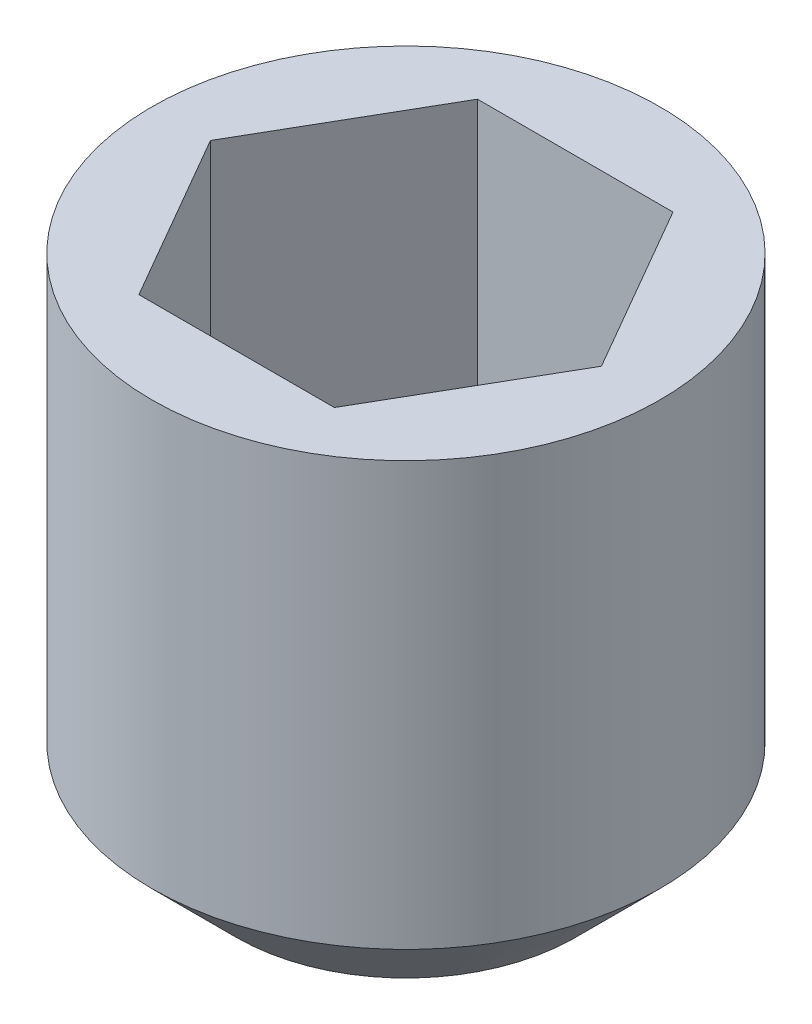
ISO-10303-21;
HEADER;
FILE_DESCRIPTION(('STEP AP214'),'2;1');
FILE_NAME('part.step','',(''),(''),'','','');
FILE_SCHEMA(('AUTOMOTIVE_DESIGN { 1 0 10303 214 1 1 1 1 }'));
ENDSEC;
DATA;
#1=APPLICATION_CONTEXT('core data for automotive mechanical design processes');
#2=APPLICATION_PROTOCOL_DEFINITION('international standard','automotive_design',2000,#1);
#3=PRODUCT_CONTEXT('',#1,'mechanical');
#4=PRODUCT('Part','Part','',(#3));
#5=PRODUCT_RELATED_PRODUCT_CATEGORY('part','',(#4));
#6=PRODUCT_DEFINITION_FORMATION('','',#4);
#7=PRODUCT_DEFINITION_CONTEXT('part definition',#1,'design');
#8=PRODUCT_DEFINITION('design','',#6,#7);
#9=PRODUCT_DEFINITION_SHAPE('','',#8);
#10=(LENGTH_UNIT() NAMED_UNIT(*) SI_UNIT(.MILLI.,.METRE.));
#11=(NAMED_UNIT(*) PLANE_ANGLE_UNIT() SI_UNIT($,.RADIAN.));
#12=(NAMED_UNIT(*) SI_UNIT($,.STERADIAN.) SOLID_ANGLE_UNIT());
#13=UNCERTAINTY_MEASURE_WITH_UNIT(LENGTH_MEASURE(1.E-05),#10,'distance_accuracy_value','');
#14=(GEOMETRIC_REPRESENTATION_CONTEXT(3) GLOBAL_UNCERTAINTY_ASSIGNED_CONTEXT((#13)) GLOBAL_UNIT_ASSIGNED_CONTEXT((#10,
#11,#12)) REPRESENTATION_CONTEXT('',''));
#15=CARTESIAN_POINT('',(0.,0.,0.));
#16=DIRECTION('',(0.,0.,1.));
#17=DIRECTION('',(1.,0.,0.));
#18=AXIS2_PLACEMENT_3D('',#15,#16,#17);
#19=CARTESIAN_POINT('',(0.,3.,0.));
#20=DIRECTION('',(0.,-1.,0.));
#21=DIRECTION('',(0.,0.,-1.));
#22=AXIS2_PLACEMENT_3D('',#19,#20,#21);
#23=CYLINDRICAL_SURFACE('',#22,1.5);
#24=CARTESIAN_POINT('',(0.,0.5,0.));
#25=DIRECTION('',(0.,1.,0.));
#26=DIRECTION('',(0.,0.,1.));
#27=AXIS2_PLACEMENT_3D('',#24,#25,#26);
#28=CIRCLE('',#27,1.5);
#29=CARTESIAN_POINT('',(0.,0.5,1.5));
#30=VERTEX_POINT('',#29);
#31=EDGE_CURVE('E42',#30,#30,#28,.T.);
#32=ORIENTED_EDGE('',*,*,#31,.T.);
#33=EDGE_LOOP('',(#32));
#34=FACE_BOUND('',#33,.T.);
#35=CARTESIAN_POINT('',(0.,3.,0.));
#36=DIRECTION('',(0.,1.,0.));
#37=DIRECTION('',(0.,0.,1.));
#38=AXIS2_PLACEMENT_3D('',#35,#36,#37);
#39=CIRCLE('',#38,1.5);
#40=CARTESIAN_POINT('',(0.,3.,1.5));
#41=VERTEX_POINT('',#40);
#42=EDGE_CURVE('E136',#41,#41,#39,.T.);
#43=ORIENTED_EDGE('',*,*,#42,.F.);
#44=EDGE_LOOP('',(#43));
#45=FACE_BOUND('',#44,.T.);
#46=ADVANCED_FACE('F34',(#34,#45),#23,.T.);
#47=CARTESIAN_POINT('',(0.,3.,0.));
#48=DIRECTION('',(0.,1.,0.));
#49=DIRECTION('',(0.,0.,1.));
#50=AXIS2_PLACEMENT_3D('',#47,#48,#49);
#51=PLANE('',#50);
#52=DIRECTION('',(1.,0.,0.));
#53=VECTOR('',#52,1.);
#54=CARTESIAN_POINT('',(-0.577350269189626,3.,1.));
#55=LINE('',#54,#53);
#56=CARTESIAN_POINT('',(-0.577350269189626,3.,1.));
#57=VERTEX_POINT('',#56);
#58=CARTESIAN_POINT('',(0.577350269189626,3.,1.));
#59=VERTEX_POINT('',#58);
#60=EDGE_CURVE('E49',#57,#59,#55,.T.);
#61=ORIENTED_EDGE('',*,*,#60,.F.);
#62=DIRECTION('',(0.5,0.,0.866025403784439));
#63=VECTOR('',#62,1.);
#64=CARTESIAN_POINT('',(-1.15470053837925,3.,0.));
#65=LINE('',#64,#63);
#66=CARTESIAN_POINT('',(-1.15470053837925,3.,0.));
#67=VERTEX_POINT('',#66);
#68=EDGE_CURVE('E132',#67,#57,#65,.T.);
#69=ORIENTED_EDGE('',*,*,#68,.F.);
#70=DIRECTION('',(-0.5,0.,0.866025403784438));
#71=VECTOR('',#70,1.);
#72=CARTESIAN_POINT('',(-0.577350269189626,3.,-1.));
#73=LINE('',#72,#71);
#74=CARTESIAN_POINT('',(-0.577350269189626,3.,-1.));
#75=VERTEX_POINT('',#74);
#76=EDGE_CURVE('E130',#75,#67,#73,.T.);
#77=ORIENTED_EDGE('',*,*,#76,.F.);
#78=DIRECTION('',(-1.,0.,0.));
#79=VECTOR('',#78,1.);
#80=CARTESIAN_POINT('',(0.577350269189625,3.,-1.));
#81=LINE('',#80,#79);
#82=CARTESIAN_POINT('',(0.577350269189625,3.,-1.));
#83=VERTEX_POINT('',#82);
#84=EDGE_CURVE('E97',#83,#75,#81,.T.);
#85=ORIENTED_EDGE('',*,*,#84,.F.);
#86=DIRECTION('',(-0.5,0.,-0.866025403784438));
#87=VECTOR('',#86,1.);
#88=CARTESIAN_POINT('',(1.15470053837925,3.,0.));
#89=LINE('',#88,#87);
#90=CARTESIAN_POINT('',(1.15470053837925,3.,0.));
#91=VERTEX_POINT('',#90);
#92=EDGE_CURVE('E126',#91,#83,#89,.T.);
#93=ORIENTED_EDGE('',*,*,#92,.F.);
#94=DIRECTION('',(0.5,0.,-0.866025403784439));
#95=VECTOR('',#94,1.);
#96=CARTESIAN_POINT('',(0.577350269189626,3.,1.));
#97=LINE('',#96,#95);
#98=EDGE_CURVE('E123',#59,#91,#97,.T.);
#99=ORIENTED_EDGE('',*,*,#98,.F.);
#100=EDGE_LOOP('',(#61,#69,#77,#85,#93,#99));
#101=FACE_BOUND('',#100,.T.);
#102=ORIENTED_EDGE('',*,*,#42,.T.);
#103=EDGE_LOOP('',(#102));
#104=FACE_BOUND('',#103,.T.);
#105=ADVANCED_FACE('F158',(#101,#104),#51,.T.);
#106=CARTESIAN_POINT('',(0.,0.,0.));
#107=DIRECTION('',(0.,1.,0.));
#108=DIRECTION('',(0.,0.,1.));
#109=AXIS2_PLACEMENT_3D('',#106,#107,#108);
#110=PLANE('',#109);
#111=CARTESIAN_POINT('',(0.,0.,0.));
#112=DIRECTION('',(0.,1.,0.));
#113=DIRECTION('',(0.,0.,1.));
#114=AXIS2_PLACEMENT_3D('',#111,#112,#113);
#115=CIRCLE('',#114,0.999999999999999);
#116=CARTESIAN_POINT('',(0.,0.,0.999999999999999));
#117=VERTEX_POINT('',#116);
#118=EDGE_CURVE('E11',#117,#117,#115,.F.);
#119=ORIENTED_EDGE('',*,*,#118,.T.);
#120=EDGE_LOOP('',(#119));
#121=FACE_BOUND('',#120,.T.);
#122=ADVANCED_FACE('F150',(#121),#110,.F.);
#123=CARTESIAN_POINT('',(0.,0.5,0.));
#124=DIRECTION('',(0.,1.,0.));
#125=DIRECTION('',(0.,0.,1.));
#126=AXIS2_PLACEMENT_3D('',#123,#124,#125);
#127=CONICAL_SURFACE('',#126,1.5,0.78539816339745);
#128=ORIENTED_EDGE('',*,*,#118,.F.);
#129=EDGE_LOOP('',(#128));
#130=FACE_BOUND('',#129,.T.);
#131=ORIENTED_EDGE('',*,*,#31,.F.);
#132=EDGE_LOOP('',(#131));
#133=FACE_BOUND('',#132,.T.);
#134=ADVANCED_FACE('F36',(#130,#133),#127,.T.);
#135=CARTESIAN_POINT('',(-0.577350269189626,1.5,1.));
#136=DIRECTION('',(0.,0.,1.));
#137=DIRECTION('',(1.,0.,0.));
#138=AXIS2_PLACEMENT_3D('',#135,#136,#137);
#139=PLANE('',#138);
#140=ORIENTED_EDGE('',*,*,#60,.T.);
#141=DIRECTION('',(0.,1.,0.));
#142=VECTOR('',#141,1.);
#143=CARTESIAN_POINT('',(0.577350269189626,1.5,1.));
#144=LINE('',#143,#142);
#145=CARTESIAN_POINT('',(0.577350269189626,1.5,1.));
#146=VERTEX_POINT('',#145);
#147=EDGE_CURVE('E79',#146,#59,#144,.T.);
#148=ORIENTED_EDGE('',*,*,#147,.F.);
#149=DIRECTION('',(1.,0.,0.));
#150=VECTOR('',#149,1.);
#151=CARTESIAN_POINT('',(-0.577350269189626,1.5,1.));
#152=LINE('',#151,#150);
#153=CARTESIAN_POINT('',(-0.577350269189626,1.5,1.));
#154=VERTEX_POINT('',#153);
#155=EDGE_CURVE('E134',#154,#146,#152,.T.);
#156=ORIENTED_EDGE('',*,*,#155,.F.);
#157=DIRECTION('',(0.,1.,0.));
#158=VECTOR('',#157,1.);
#159=CARTESIAN_POINT('',(-0.577350269189626,1.5,1.));
#160=LINE('',#159,#158);
#161=EDGE_CURVE('E57',#154,#57,#160,.T.);
#162=ORIENTED_EDGE('',*,*,#161,.T.);
#163=EDGE_LOOP('',(#140,#148,#156,#162));
#164=FACE_BOUND('',#163,.T.);
#165=ADVANCED_FACE('F149',(#164),#139,.F.);
#166=CARTESIAN_POINT('',(-1.15470053837925,1.5,0.));
#167=DIRECTION('',(-0.866025403784439,0.,0.5));
#168=DIRECTION('',(0.5,0.,0.866025403784439));
#169=AXIS2_PLACEMENT_3D('',#166,#167,#168);
#170=PLANE('',#169);
#171=ORIENTED_EDGE('',*,*,#68,.T.);
#172=ORIENTED_EDGE('',*,*,#161,.F.);
#173=DIRECTION('',(0.5,0.,0.866025403784439));
#174=VECTOR('',#173,1.);
#175=CARTESIAN_POINT('',(-1.15470053837925,1.5,0.));
#176=LINE('',#175,#174);
#177=CARTESIAN_POINT('',(-1.15470053837925,1.5,0.));
#178=VERTEX_POINT('',#177);
#179=EDGE_CURVE('E109',#178,#154,#176,.T.);
#180=ORIENTED_EDGE('',*,*,#179,.F.);
#181=DIRECTION('',(0.,1.,0.));
#182=VECTOR('',#181,1.);
#183=CARTESIAN_POINT('',(-1.15470053837925,1.5,0.));
#184=LINE('',#183,#182);
#185=EDGE_CURVE('E101',#178,#67,#184,.T.);
#186=ORIENTED_EDGE('',*,*,#185,.T.);
#187=EDGE_LOOP('',(#171,#172,#180,#186));
#188=FACE_BOUND('',#187,.T.);
#189=ADVANCED_FACE('F156',(#188),#170,.F.);
#190=CARTESIAN_POINT('',(-0.577350269189626,1.5,-1.));
#191=DIRECTION('',(-0.866025403784439,0.,-0.5));
#192=DIRECTION('',(-0.5,0.,0.866025403784439));
#193=AXIS2_PLACEMENT_3D('',#190,#191,#192);
#194=PLANE('',#193);
#195=ORIENTED_EDGE('',*,*,#76,.T.);
#196=ORIENTED_EDGE('',*,*,#185,.F.);
#197=DIRECTION('',(-0.5,0.,0.866025403784438));
#198=VECTOR('',#197,1.);
#199=CARTESIAN_POINT('',(-0.577350269189626,1.5,-1.));
#200=LINE('',#199,#198);
#201=CARTESIAN_POINT('',(-0.577350269189626,1.5,-1.));
#202=VERTEX_POINT('',#201);
#203=EDGE_CURVE('E105',#202,#178,#200,.T.);
#204=ORIENTED_EDGE('',*,*,#203,.F.);
#205=DIRECTION('',(0.,1.,0.));
#206=VECTOR('',#205,1.);
#207=CARTESIAN_POINT('',(-0.577350269189626,1.5,-1.));
#208=LINE('',#207,#206);
#209=EDGE_CURVE('E90',#202,#75,#208,.T.);
#210=ORIENTED_EDGE('',*,*,#209,.T.);
#211=EDGE_LOOP('',(#195,#196,#204,#210));
#212=FACE_BOUND('',#211,.T.);
#213=ADVANCED_FACE('F106',(#212),#194,.F.);
#214=CARTESIAN_POINT('',(0.577350269189625,1.5,-1.));
#215=DIRECTION('',(0.,0.,-1.));
#216=DIRECTION('',(-1.,0.,0.));
#217=AXIS2_PLACEMENT_3D('',#214,#215,#216);
#218=PLANE('',#217);
#219=ORIENTED_EDGE('',*,*,#84,.T.);
#220=ORIENTED_EDGE('',*,*,#209,.F.);
#221=DIRECTION('',(-1.,0.,0.));
#222=VECTOR('',#221,1.);
#223=CARTESIAN_POINT('',(0.577350269189625,1.5,-1.));
#224=LINE('',#223,#222);
#225=CARTESIAN_POINT('',(0.577350269189625,1.5,-1.));
#226=VERTEX_POINT('',#225);
#227=EDGE_CURVE('E94',#226,#202,#224,.T.);
#228=ORIENTED_EDGE('',*,*,#227,.F.);
#229=DIRECTION('',(0.,1.,0.));
#230=VECTOR('',#229,1.);
#231=CARTESIAN_POINT('',(0.577350269189625,1.5,-1.));
#232=LINE('',#231,#230);
#233=EDGE_CURVE('E102',#226,#83,#232,.T.);
#234=ORIENTED_EDGE('',*,*,#233,.T.);
#235=EDGE_LOOP('',(#219,#220,#228,#234));
#236=FACE_BOUND('',#235,.T.);
#237=ADVANCED_FACE('F92',(#236),#218,.F.);
#238=CARTESIAN_POINT('',(1.15470053837925,1.5,0.));
#239=DIRECTION('',(0.866025403784439,0.,-0.5));
#240=DIRECTION('',(-0.5,0.,-0.866025403784439));
#241=AXIS2_PLACEMENT_3D('',#238,#239,#240);
#242=PLANE('',#241);
#243=ORIENTED_EDGE('',*,*,#92,.T.);
#244=ORIENTED_EDGE('',*,*,#233,.F.);
#245=DIRECTION('',(-0.5,0.,-0.866025403784438));
#246=VECTOR('',#245,1.);
#247=CARTESIAN_POINT('',(1.15470053837925,1.5,0.));
#248=LINE('',#247,#246);
#249=CARTESIAN_POINT('',(1.15470053837925,1.5,0.));
#250=VERTEX_POINT('',#249);
#251=EDGE_CURVE('E115',#250,#226,#248,.T.);
#252=ORIENTED_EDGE('',*,*,#251,.F.);
#253=DIRECTION('',(0.,1.,0.));
#254=VECTOR('',#253,1.);
#255=CARTESIAN_POINT('',(1.15470053837925,1.5,0.));
#256=LINE('',#255,#254);
#257=EDGE_CURVE('E139',#250,#91,#256,.T.);
#258=ORIENTED_EDGE('',*,*,#257,.T.);
#259=EDGE_LOOP('',(#243,#244,#252,#258));
#260=FACE_BOUND('',#259,.T.);
#261=ADVANCED_FACE('F172',(#260),#242,.F.);
#262=CARTESIAN_POINT('',(0.577350269189626,1.5,1.));
#263=DIRECTION('',(0.866025403784438,0.,0.5));
#264=DIRECTION('',(0.5,0.,-0.866025403784439));
#265=AXIS2_PLACEMENT_3D('',#262,#263,#264);
#266=PLANE('',#265);
#267=ORIENTED_EDGE('',*,*,#98,.T.);
#268=ORIENTED_EDGE('',*,*,#257,.F.);
#269=DIRECTION('',(0.5,0.,-0.866025403784439));
#270=VECTOR('',#269,1.);
#271=CARTESIAN_POINT('',(0.577350269189626,1.5,1.));
#272=LINE('',#271,#270);
#273=EDGE_CURVE('E117',#146,#250,#272,.T.);
#274=ORIENTED_EDGE('',*,*,#273,.F.);
#275=ORIENTED_EDGE('',*,*,#147,.T.);
#276=EDGE_LOOP('',(#267,#268,#274,#275));
#277=FACE_BOUND('',#276,.T.);
#278=ADVANCED_FACE('F169',(#277),#266,.F.);
#279=CARTESIAN_POINT('',(0.,1.5,0.));
#280=DIRECTION('',(0.,1.,0.));
#281=DIRECTION('',(0.,0.,1.));
#282=AXIS2_PLACEMENT_3D('',#279,#280,#281);
#283=PLANE('',#282);
#284=ORIENTED_EDGE('',*,*,#155,.T.);
#285=ORIENTED_EDGE('',*,*,#273,.T.);
#286=ORIENTED_EDGE('',*,*,#251,.T.);
#287=ORIENTED_EDGE('',*,*,#227,.T.);
#288=ORIENTED_EDGE('',*,*,#203,.T.);
#289=ORIENTED_EDGE('',*,*,#179,.T.);
#290=EDGE_LOOP('',(#284,#285,#286,#287,#288,#289));
#291=FACE_BOUND('',#290,.T.);
#292=ADVANCED_FACE('F112',(#291),#283,.T.);
#293=CLOSED_SHELL('',(#46,#105,#122,#134,#165,#189,#213,#237,#261,#278,#292));
#294=MANIFOLD_SOLID_BREP('B2',#293);
#295=ADVANCED_BREP_SHAPE_REPRESENTATION('',(#18,#294),#14);
#296=SHAPE_DEFINITION_REPRESENTATION(#9,#295);
ENDSEC;
END-ISO-10303-21;
